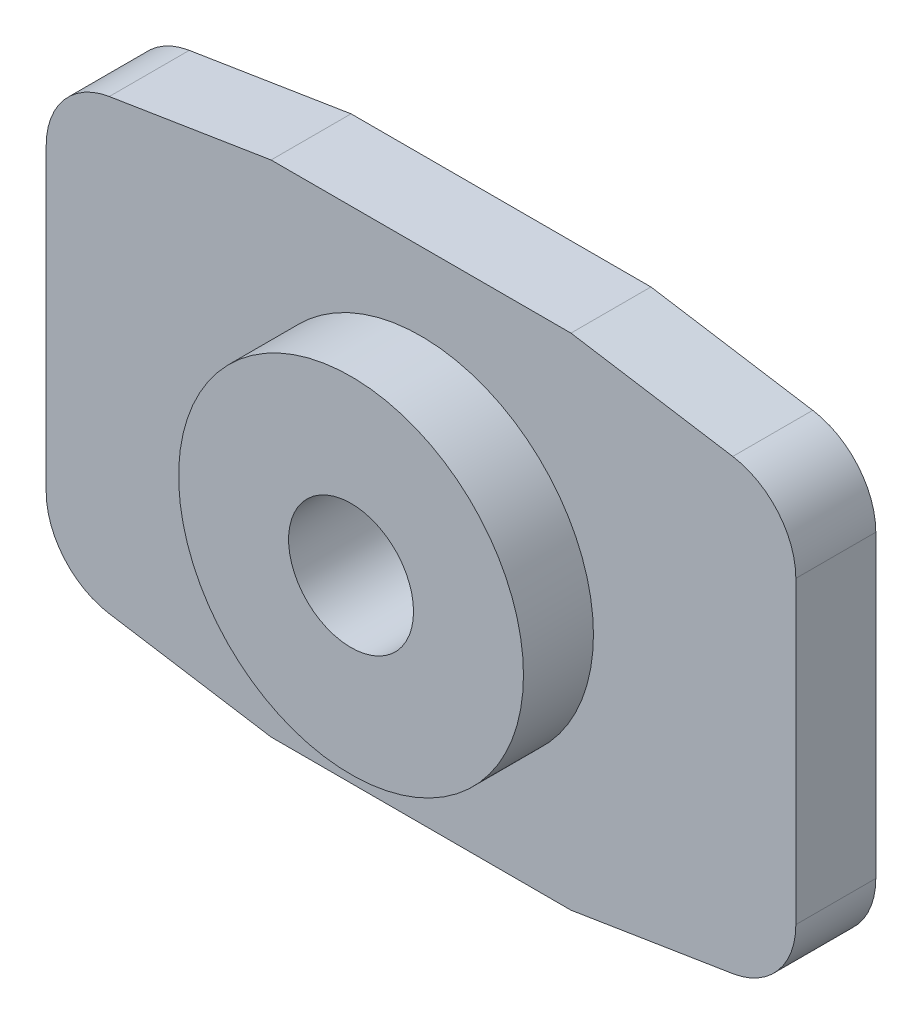
ISO-10303-21;
HEADER;
FILE_DESCRIPTION(('STEP AP214'),'2;1');
FILE_NAME('part.step','',(''),(''),'','','');
FILE_SCHEMA(('AUTOMOTIVE_DESIGN { 1 0 10303 214 1 1 1 1 }'));
ENDSEC;
DATA;
#1=APPLICATION_CONTEXT('core data for automotive mechanical design processes');
#2=APPLICATION_PROTOCOL_DEFINITION('international standard','automotive_design',2000,#1);
#3=PRODUCT_CONTEXT('',#1,'mechanical');
#4=PRODUCT('Part','Part','',(#3));
#5=PRODUCT_RELATED_PRODUCT_CATEGORY('part','',(#4));
#6=PRODUCT_DEFINITION_FORMATION('','',#4);
#7=PRODUCT_DEFINITION_CONTEXT('part definition',#1,'design');
#8=PRODUCT_DEFINITION('design','',#6,#7);
#9=PRODUCT_DEFINITION_SHAPE('','',#8);
#10=(LENGTH_UNIT() NAMED_UNIT(*) SI_UNIT(.MILLI.,.METRE.));
#11=(NAMED_UNIT(*) PLANE_ANGLE_UNIT() SI_UNIT($,.RADIAN.));
#12=(NAMED_UNIT(*) SI_UNIT($,.STERADIAN.) SOLID_ANGLE_UNIT());
#13=UNCERTAINTY_MEASURE_WITH_UNIT(LENGTH_MEASURE(1.E-05),#10,'distance_accuracy_value','');
#14=(GEOMETRIC_REPRESENTATION_CONTEXT(3) GLOBAL_UNCERTAINTY_ASSIGNED_CONTEXT((#13)) GLOBAL_UNIT_ASSIGNED_CONTEXT((#10,
#11,#12)) REPRESENTATION_CONTEXT('',''));
#15=CARTESIAN_POINT('',(0.,0.,0.));
#16=DIRECTION('',(0.,0.,1.));
#17=DIRECTION('',(1.,0.,0.));
#18=AXIS2_PLACEMENT_3D('',#15,#16,#17);
#19=CARTESIAN_POINT('',(6.00000000000023,3.00000000000011,1.60000000000242));
#20=DIRECTION('',(0.,0.,1.));
#21=DIRECTION('',(1.,0.,0.));
#22=AXIS2_PLACEMENT_3D('',#19,#20,#21);
#23=PLANE('',#22);
#24=CARTESIAN_POINT('',(6.00000000000023,3.00000000000011,1.60000000000242));
#25=DIRECTION('',(0.,0.,1.));
#26=DIRECTION('',(1.,0.,0.));
#27=AXIS2_PLACEMENT_3D('',#24,#25,#26);
#28=CIRCLE('',#27,1.5);
#29=CARTESIAN_POINT('',(7.50000000000028,3.00000000000011,1.6000000000044));
#30=VERTEX_POINT('',#29);
#31=CARTESIAN_POINT('',(6.23739675280444,4.48109512920603,1.60000000000005));
#32=VERTEX_POINT('',#31);
#33=EDGE_CURVE('E180',#30,#32,#28,.T.);
#34=ORIENTED_EDGE('',*,*,#33,.T.);
#35=DIRECTION('',(-0.987396752804084,0.158264501869387,0.));
#36=VECTOR('',#35,1.);
#37=CARTESIAN_POINT('',(6.23739675280444,4.48109512920603,1.60000000000005));
#38=LINE('',#37,#36);
#39=CARTESIAN_POINT('',(3.00000000000011,4.99999999999989,1.60000000000426));
#40=VERTEX_POINT('',#39);
#41=EDGE_CURVE('E108',#32,#40,#38,.T.);
#42=ORIENTED_EDGE('',*,*,#41,.T.);
#43=DIRECTION('',(-1.,0.,0.));
#44=VECTOR('',#43,1.);
#45=CARTESIAN_POINT('',(-3.00000000000011,4.99999999999989,1.60000000000456));
#46=LINE('',#45,#44);
#47=CARTESIAN_POINT('',(-3.00000000000011,4.99999999999989,1.60000000000456));
#48=VERTEX_POINT('',#47);
#49=EDGE_CURVE('E207',#40,#48,#46,.T.);
#50=ORIENTED_EDGE('',*,*,#49,.T.);
#51=DIRECTION('',(-0.987396752804084,-0.158264501869387,0.));
#52=VECTOR('',#51,1.);
#53=CARTESIAN_POINT('',(-6.23739675280444,4.48109512920603,1.60000000000016));
#54=LINE('',#53,#52);
#55=CARTESIAN_POINT('',(-6.23739675280444,4.48109512920603,1.60000000000016));
#56=VERTEX_POINT('',#55);
#57=EDGE_CURVE('E225',#48,#56,#54,.T.);
#58=ORIENTED_EDGE('',*,*,#57,.T.);
#59=CARTESIAN_POINT('',(-6.00000000000023,3.00000000000011,1.60000000000254));
#60=DIRECTION('',(0.,0.,1.));
#61=DIRECTION('',(-1.,0.,0.));
#62=AXIS2_PLACEMENT_3D('',#59,#60,#61);
#63=CIRCLE('',#62,1.5);
#64=CARTESIAN_POINT('',(-7.50000000000028,3.00000000000011,1.60000000000447));
#65=VERTEX_POINT('',#64);
#66=EDGE_CURVE('E222',#56,#65,#63,.T.);
#67=ORIENTED_EDGE('',*,*,#66,.T.);
#68=DIRECTION('',(0.,-1.,0.));
#69=VECTOR('',#68,1.);
#70=CARTESIAN_POINT('',(-7.50000000000028,-3.00000000000011,1.60000000000435));
#71=LINE('',#70,#69);
#72=CARTESIAN_POINT('',(-7.50000000000028,-3.00000000000011,1.60000000000435));
#73=VERTEX_POINT('',#72);
#74=EDGE_CURVE('E224',#65,#73,#71,.T.);
#75=ORIENTED_EDGE('',*,*,#74,.T.);
#76=CARTESIAN_POINT('',(-6.00000000000023,-3.00000000000011,1.60000000000259));
#77=DIRECTION('',(0.,0.,1.));
#78=DIRECTION('',(1.,0.,0.));
#79=AXIS2_PLACEMENT_3D('',#76,#77,#78);
#80=CIRCLE('',#79,1.5);
#81=CARTESIAN_POINT('',(-6.23739675280444,-4.48109512920603,1.60000000000024));
#82=VERTEX_POINT('',#81);
#83=EDGE_CURVE('E227',#73,#82,#80,.T.);
#84=ORIENTED_EDGE('',*,*,#83,.T.);
#85=DIRECTION('',(0.987396752804083,-0.158264501869386,0.));
#86=VECTOR('',#85,1.);
#87=CARTESIAN_POINT('',(-6.23739675280444,-4.48109512920603,1.60000000000024));
#88=LINE('',#87,#86);
#89=CARTESIAN_POINT('',(-3.00000000000011,-4.99999999999989,1.59999999999949));
#90=VERTEX_POINT('',#89);
#91=EDGE_CURVE('E233',#82,#90,#88,.T.);
#92=ORIENTED_EDGE('',*,*,#91,.T.);
#93=DIRECTION('',(1.,0.,0.));
#94=VECTOR('',#93,1.);
#95=CARTESIAN_POINT('',(-3.00000000000011,-4.99999999999989,1.59999999999949));
#96=LINE('',#95,#94);
#97=CARTESIAN_POINT('',(3.00000000000011,-4.99999999999989,1.59999999999984));
#98=VERTEX_POINT('',#97);
#99=EDGE_CURVE('E139',#90,#98,#96,.T.);
#100=ORIENTED_EDGE('',*,*,#99,.T.);
#101=DIRECTION('',(0.987396752804084,0.158264501869386,0.));
#102=VECTOR('',#101,1.);
#103=CARTESIAN_POINT('',(6.23739675280444,-4.48109512920603,1.59999999999987));
#104=LINE('',#103,#102);
#105=CARTESIAN_POINT('',(6.23739675280444,-4.48109512920603,1.59999999999987));
#106=VERTEX_POINT('',#105);
#107=EDGE_CURVE('E133',#98,#106,#104,.T.);
#108=ORIENTED_EDGE('',*,*,#107,.T.);
#109=CARTESIAN_POINT('',(6.00000000000023,-3.00000000000011,1.60000000000253));
#110=DIRECTION('',(0.,0.,1.));
#111=DIRECTION('',(-1.,0.,0.));
#112=AXIS2_PLACEMENT_3D('',#109,#110,#111);
#113=CIRCLE('',#112,1.5);
#114=CARTESIAN_POINT('',(7.50000000000028,-3.00000000000011,1.60000000000429));
#115=VERTEX_POINT('',#114);
#116=EDGE_CURVE('E137',#106,#115,#113,.T.);
#117=ORIENTED_EDGE('',*,*,#116,.T.);
#118=DIRECTION('',(0.,1.,0.));
#119=VECTOR('',#118,1.);
#120=CARTESIAN_POINT('',(7.50000000000028,-3.00000000000011,1.60000000000429));
#121=LINE('',#120,#119);
#122=EDGE_CURVE('E53',#115,#30,#121,.T.);
#123=ORIENTED_EDGE('',*,*,#122,.T.);
#124=EDGE_LOOP('',(#34,#42,#50,#58,#67,#75,#84,#92,#100,#108,#117,#123));
#125=FACE_BOUND('',#124,.T.);
#126=CARTESIAN_POINT('',(0.,0.,1.60000000000006));
#127=DIRECTION('',(0.,0.,1.));
#128=DIRECTION('',(1.,0.,0.));
#129=AXIS2_PLACEMENT_3D('',#126,#127,#128);
#130=CIRCLE('',#129,3.45);
#131=CARTESIAN_POINT('',(3.45000000000002,0.,1.60000000000006));
#132=VERTEX_POINT('',#131);
#133=EDGE_CURVE('E285',#132,#132,#130,.T.);
#134=ORIENTED_EDGE('',*,*,#133,.F.);
#135=EDGE_LOOP('',(#134));
#136=FACE_BOUND('',#135,.T.);
#137=ADVANCED_FACE('F36',(#125,#136),#23,.T.);
#138=CARTESIAN_POINT('',(6.00000000000023,3.00000000000011,1.60000000000242));
#139=DIRECTION('',(0.,0.,-1.));
#140=DIRECTION('',(-1.,0.,0.));
#141=AXIS2_PLACEMENT_3D('',#138,#139,#140);
#142=CYLINDRICAL_SURFACE('',#141,1.5);
#143=CARTESIAN_POINT('',(6.00000000000023,3.00000000000011,2.38697950294409E-12));
#144=DIRECTION('',(0.,0.,1.));
#145=DIRECTION('',(1.,0.,0.));
#146=AXIS2_PLACEMENT_3D('',#143,#144,#145);
#147=CIRCLE('',#146,1.5);
#148=CARTESIAN_POINT('',(7.50000000000028,3.00000000000011,4.56579218877096E-12));
#149=VERTEX_POINT('',#148);
#150=CARTESIAN_POINT('',(6.23739675280444,4.48109512920603,3.05311331771918E-13));
#151=VERTEX_POINT('',#150);
#152=EDGE_CURVE('E157',#149,#151,#147,.T.);
#153=ORIENTED_EDGE('',*,*,#152,.T.);
#154=DIRECTION('',(0.,0.,-1.));
#155=VECTOR('',#154,1.);
#156=CARTESIAN_POINT('',(6.23739675280444,4.48109512920603,1.60000000000005));
#157=LINE('',#156,#155);
#158=EDGE_CURVE('E11',#32,#151,#157,.T.);
#159=ORIENTED_EDGE('',*,*,#158,.F.);
#160=ORIENTED_EDGE('',*,*,#33,.F.);
#161=DIRECTION('',(0.,0.,-1.));
#162=VECTOR('',#161,1.);
#163=CARTESIAN_POINT('',(7.50000000000028,3.00000000000011,1.6000000000044));
#164=LINE('',#163,#162);
#165=EDGE_CURVE('E153',#30,#149,#164,.T.);
#166=ORIENTED_EDGE('',*,*,#165,.T.);
#167=EDGE_LOOP('',(#153,#159,#160,#166));
#168=FACE_BOUND('',#167,.T.);
#169=ADVANCED_FACE('F38',(#168),#142,.T.);
#170=CARTESIAN_POINT('',(6.23739675280444,4.48109512920603,1.60000000000005));
#171=DIRECTION('',(-0.158264501869386,-0.987396752804081,0.));
#172=DIRECTION('',(0.987396752804084,-0.158264501869387,0.));
#173=AXIS2_PLACEMENT_3D('',#170,#171,#172);
#174=PLANE('',#173);
#175=DIRECTION('',(-0.987396752804084,0.158264501869387,0.));
#176=VECTOR('',#175,1.);
#177=CARTESIAN_POINT('',(6.23739675280444,4.48109512920603,3.05311331771918E-13));
#178=LINE('',#177,#176);
#179=CARTESIAN_POINT('',(3.00000000000011,4.99999999999989,4.34374758384592E-12));
#180=VERTEX_POINT('',#179);
#181=EDGE_CURVE('E160',#151,#180,#178,.T.);
#182=ORIENTED_EDGE('',*,*,#181,.T.);
#183=DIRECTION('',(0.,0.,-1.));
#184=VECTOR('',#183,1.);
#185=CARTESIAN_POINT('',(3.00000000000011,4.99999999999989,1.60000000000426));
#186=LINE('',#185,#184);
#187=EDGE_CURVE('E45',#40,#180,#186,.T.);
#188=ORIENTED_EDGE('',*,*,#187,.F.);
#189=ORIENTED_EDGE('',*,*,#41,.F.);
#190=ORIENTED_EDGE('',*,*,#158,.T.);
#191=EDGE_LOOP('',(#182,#188,#189,#190));
#192=FACE_BOUND('',#191,.T.);
#193=ADVANCED_FACE('F263',(#192),#174,.F.);
#194=CARTESIAN_POINT('',(-3.00000000000011,4.99999999999989,1.60000000000456));
#195=DIRECTION('',(0.,-1.,0.));
#196=DIRECTION('',(0.,0.,-1.));
#197=AXIS2_PLACEMENT_3D('',#194,#195,#196);
#198=PLANE('',#197);
#199=DIRECTION('',(-1.,0.,0.));
#200=VECTOR('',#199,1.);
#201=CARTESIAN_POINT('',(-3.00000000000011,4.99999999999989,4.21884749357559E-12));
#202=LINE('',#201,#200);
#203=CARTESIAN_POINT('',(-3.00000000000011,4.99999999999989,4.21884749357559E-12));
#204=VERTEX_POINT('',#203);
#205=EDGE_CURVE('E163',#180,#204,#202,.T.);
#206=ORIENTED_EDGE('',*,*,#205,.T.);
#207=DIRECTION('',(0.,0.,-1.));
#208=VECTOR('',#207,1.);
#209=CARTESIAN_POINT('',(-3.00000000000011,4.99999999999989,1.60000000000456));
#210=LINE('',#209,#208);
#211=EDGE_CURVE('E199',#48,#204,#210,.T.);
#212=ORIENTED_EDGE('',*,*,#211,.F.);
#213=ORIENTED_EDGE('',*,*,#49,.F.);
#214=ORIENTED_EDGE('',*,*,#187,.T.);
#215=EDGE_LOOP('',(#206,#212,#213,#214));
#216=FACE_BOUND('',#215,.T.);
#217=ADVANCED_FACE('F205',(#216),#198,.F.);
#218=CARTESIAN_POINT('',(-6.23739675280444,4.48109512920603,1.60000000000016));
#219=DIRECTION('',(0.158264501869387,-0.987396752804081,0.));
#220=DIRECTION('',(0.987396752804083,0.158264501869386,0.));
#221=AXIS2_PLACEMENT_3D('',#218,#219,#220);
#222=PLANE('',#221);
#223=DIRECTION('',(-0.987396752804084,-0.158264501869387,0.));
#224=VECTOR('',#223,1.);
#225=CARTESIAN_POINT('',(-6.23739675280444,4.48109512920603,2.22044604925031E-13));
#226=LINE('',#225,#224);
#227=CARTESIAN_POINT('',(-6.23739675280444,4.48109512920603,2.22044604925031E-13));
#228=VERTEX_POINT('',#227);
#229=EDGE_CURVE('E165',#204,#228,#226,.T.);
#230=ORIENTED_EDGE('',*,*,#229,.T.);
#231=DIRECTION('',(0.,0.,-1.));
#232=VECTOR('',#231,1.);
#233=CARTESIAN_POINT('',(-6.23739675280444,4.48109512920603,1.60000000000016));
#234=LINE('',#233,#232);
#235=EDGE_CURVE('E196',#56,#228,#234,.T.);
#236=ORIENTED_EDGE('',*,*,#235,.F.);
#237=ORIENTED_EDGE('',*,*,#57,.F.);
#238=ORIENTED_EDGE('',*,*,#211,.T.);
#239=EDGE_LOOP('',(#230,#236,#237,#238));
#240=FACE_BOUND('',#239,.T.);
#241=ADVANCED_FACE('F216',(#240),#222,.F.);
#242=CARTESIAN_POINT('',(-6.00000000000023,3.00000000000011,1.60000000000254));
#243=DIRECTION('',(0.,0.,-1.));
#244=DIRECTION('',(-1.,0.,0.));
#245=AXIS2_PLACEMENT_3D('',#242,#243,#244);
#246=CYLINDRICAL_SURFACE('',#245,1.5);
#247=CARTESIAN_POINT('',(-6.00000000000023,3.00000000000011,2.72004641033163E-12));
#248=DIRECTION('',(0.,0.,1.));
#249=DIRECTION('',(-1.,0.,0.));
#250=AXIS2_PLACEMENT_3D('',#247,#248,#249);
#251=CIRCLE('',#250,1.5);
#252=CARTESIAN_POINT('',(-7.50000000000028,3.00000000000011,4.48252546192407E-12));
#253=VERTEX_POINT('',#252);
#254=EDGE_CURVE('E167',#228,#253,#251,.T.);
#255=ORIENTED_EDGE('',*,*,#254,.T.);
#256=DIRECTION('',(0.,0.,-1.));
#257=VECTOR('',#256,1.);
#258=CARTESIAN_POINT('',(-7.50000000000028,3.00000000000011,1.60000000000447));
#259=LINE('',#258,#257);
#260=EDGE_CURVE('E193',#65,#253,#259,.T.);
#261=ORIENTED_EDGE('',*,*,#260,.F.);
#262=ORIENTED_EDGE('',*,*,#66,.F.);
#263=ORIENTED_EDGE('',*,*,#235,.T.);
#264=EDGE_LOOP('',(#255,#261,#262,#263));
#265=FACE_BOUND('',#264,.T.);
#266=ADVANCED_FACE('F220',(#265),#246,.T.);
#267=CARTESIAN_POINT('',(-7.50000000000028,-3.00000000000011,1.60000000000435));
#268=DIRECTION('',(1.,0.,0.));
#269=DIRECTION('',(0.,0.,-1.));
#270=AXIS2_PLACEMENT_3D('',#267,#268,#269);
#271=PLANE('',#270);
#272=DIRECTION('',(0.,-1.,0.));
#273=VECTOR('',#272,1.);
#274=CARTESIAN_POINT('',(-7.50000000000028,-3.00000000000011,4.20496970576778E-12));
#275=LINE('',#274,#273);
#276=CARTESIAN_POINT('',(-7.50000000000028,-3.00000000000011,4.20496970576778E-12));
#277=VERTEX_POINT('',#276);
#278=EDGE_CURVE('E169',#253,#277,#275,.T.);
#279=ORIENTED_EDGE('',*,*,#278,.T.);
#280=DIRECTION('',(0.,0.,-1.));
#281=VECTOR('',#280,1.);
#282=CARTESIAN_POINT('',(-7.50000000000028,-3.00000000000011,1.60000000000435));
#283=LINE('',#282,#281);
#284=EDGE_CURVE('E190',#73,#277,#283,.T.);
#285=ORIENTED_EDGE('',*,*,#284,.F.);
#286=ORIENTED_EDGE('',*,*,#74,.F.);
#287=ORIENTED_EDGE('',*,*,#260,.T.);
#288=EDGE_LOOP('',(#279,#285,#286,#287));
#289=FACE_BOUND('',#288,.T.);
#290=ADVANCED_FACE('F354',(#289),#271,.F.);
#291=CARTESIAN_POINT('',(-6.00000000000023,-3.00000000000011,1.60000000000259));
#292=DIRECTION('',(0.,0.,-1.));
#293=DIRECTION('',(-1.,0.,0.));
#294=AXIS2_PLACEMENT_3D('',#291,#292,#293);
#295=CYLINDRICAL_SURFACE('',#294,1.5);
#296=CARTESIAN_POINT('',(-6.00000000000023,-3.00000000000011,2.94209101525666E-12));
#297=DIRECTION('',(0.,0.,1.));
#298=DIRECTION('',(1.,0.,0.));
#299=AXIS2_PLACEMENT_3D('',#296,#297,#298);
#300=CIRCLE('',#299,1.5);
#301=CARTESIAN_POINT('',(-6.23739675280444,-4.48109512920603,1.11022302462516E-13));
#302=VERTEX_POINT('',#301);
#303=EDGE_CURVE('E171',#277,#302,#300,.T.);
#304=ORIENTED_EDGE('',*,*,#303,.T.);
#305=DIRECTION('',(0.,0.,-1.));
#306=VECTOR('',#305,1.);
#307=CARTESIAN_POINT('',(-6.23739675280444,-4.48109512920603,1.60000000000024));
#308=LINE('',#307,#306);
#309=EDGE_CURVE('E187',#82,#302,#308,.T.);
#310=ORIENTED_EDGE('',*,*,#309,.F.);
#311=ORIENTED_EDGE('',*,*,#83,.F.);
#312=ORIENTED_EDGE('',*,*,#284,.T.);
#313=EDGE_LOOP('',(#304,#310,#311,#312));
#314=FACE_BOUND('',#313,.T.);
#315=ADVANCED_FACE('F345',(#314),#295,.T.);
#316=CARTESIAN_POINT('',(-6.23739675280444,-4.48109512920603,1.60000000000024));
#317=DIRECTION('',(0.158264501869386,0.987396752804081,0.));
#318=DIRECTION('',(-0.987396752804084,0.158264501869386,0.));
#319=AXIS2_PLACEMENT_3D('',#316,#317,#318);
#320=PLANE('',#319);
#321=DIRECTION('',(0.987396752804083,-0.158264501869386,0.));
#322=VECTOR('',#321,1.);
#323=CARTESIAN_POINT('',(-6.23739675280444,-4.48109512920603,1.11022302462516E-13));
#324=LINE('',#323,#322);
#325=CARTESIAN_POINT('',(-3.00000000000011,-4.99999999999989,-5.13478148889135E-13));
#326=VERTEX_POINT('',#325);
#327=EDGE_CURVE('E173',#302,#326,#324,.T.);
#328=ORIENTED_EDGE('',*,*,#327,.T.);
#329=DIRECTION('',(0.,0.,-1.));
#330=VECTOR('',#329,1.);
#331=CARTESIAN_POINT('',(-3.00000000000011,-4.99999999999989,1.59999999999949));
#332=LINE('',#331,#330);
#333=EDGE_CURVE('E184',#90,#326,#332,.T.);
#334=ORIENTED_EDGE('',*,*,#333,.F.);
#335=ORIENTED_EDGE('',*,*,#91,.F.);
#336=ORIENTED_EDGE('',*,*,#309,.T.);
#337=EDGE_LOOP('',(#328,#334,#335,#336));
#338=FACE_BOUND('',#337,.T.);
#339=ADVANCED_FACE('F239',(#338),#320,.F.);
#340=CARTESIAN_POINT('',(-3.00000000000011,-4.99999999999989,1.59999999999949));
#341=DIRECTION('',(0.,1.,0.));
#342=DIRECTION('',(0.,0.,1.));
#343=AXIS2_PLACEMENT_3D('',#340,#341,#342);
#344=PLANE('',#343);
#345=DIRECTION('',(1.,0.,0.));
#346=VECTOR('',#345,1.);
#347=CARTESIAN_POINT('',(-3.00000000000011,-4.99999999999989,-5.13478148889135E-13));
#348=LINE('',#347,#346);
#349=CARTESIAN_POINT('',(3.00000000000011,-4.99999999999989,-8.04911692853238E-13));
#350=VERTEX_POINT('',#349);
#351=EDGE_CURVE('E175',#326,#350,#348,.T.);
#352=ORIENTED_EDGE('',*,*,#351,.T.);
#353=DIRECTION('',(0.,0.,-1.));
#354=VECTOR('',#353,1.);
#355=CARTESIAN_POINT('',(3.00000000000011,-4.99999999999989,1.59999999999984));
#356=LINE('',#355,#354);
#357=EDGE_CURVE('E148',#98,#350,#356,.T.);
#358=ORIENTED_EDGE('',*,*,#357,.F.);
#359=ORIENTED_EDGE('',*,*,#99,.F.);
#360=ORIENTED_EDGE('',*,*,#333,.T.);
#361=EDGE_LOOP('',(#352,#358,#359,#360));
#362=FACE_BOUND('',#361,.T.);
#363=ADVANCED_FACE('F243',(#362),#344,.F.);
#364=CARTESIAN_POINT('',(6.23739675280444,-4.48109512920603,1.59999999999987));
#365=DIRECTION('',(-0.158264501869387,0.987396752804081,0.));
#366=DIRECTION('',(-0.987396752804084,-0.158264501869386,0.));
#367=AXIS2_PLACEMENT_3D('',#364,#365,#366);
#368=PLANE('',#367);
#369=DIRECTION('',(0.987396752804084,0.158264501869386,0.));
#370=VECTOR('',#369,1.);
#371=CARTESIAN_POINT('',(6.23739675280444,-4.48109512920603,1.66533453693773E-13));
#372=LINE('',#371,#370);
#373=CARTESIAN_POINT('',(6.23739675280444,-4.48109512920603,1.66533453693773E-13));
#374=VERTEX_POINT('',#373);
#375=EDGE_CURVE('E147',#350,#374,#372,.T.);
#376=ORIENTED_EDGE('',*,*,#375,.T.);
#377=DIRECTION('',(0.,0.,-1.));
#378=VECTOR('',#377,1.);
#379=CARTESIAN_POINT('',(6.23739675280444,-4.48109512920603,1.59999999999987));
#380=LINE('',#379,#378);
#381=EDGE_CURVE('E144',#106,#374,#380,.T.);
#382=ORIENTED_EDGE('',*,*,#381,.F.);
#383=ORIENTED_EDGE('',*,*,#107,.F.);
#384=ORIENTED_EDGE('',*,*,#357,.T.);
#385=EDGE_LOOP('',(#376,#382,#383,#384));
#386=FACE_BOUND('',#385,.T.);
#387=ADVANCED_FACE('F145',(#386),#368,.F.);
#388=CARTESIAN_POINT('',(6.00000000000023,-3.00000000000011,1.60000000000253));
#389=DIRECTION('',(0.,0.,-1.));
#390=DIRECTION('',(-1.,0.,0.));
#391=AXIS2_PLACEMENT_3D('',#388,#389,#390);
#392=CYLINDRICAL_SURFACE('',#391,1.5);
#393=CARTESIAN_POINT('',(6.00000000000023,-3.00000000000011,2.4008572907519E-12));
#394=DIRECTION('',(0.,0.,1.));
#395=DIRECTION('',(-1.,0.,0.));
#396=AXIS2_PLACEMENT_3D('',#393,#394,#395);
#397=CIRCLE('',#396,1.5);
#398=CARTESIAN_POINT('',(7.50000000000028,-3.00000000000011,3.99680288865056E-12));
#399=VERTEX_POINT('',#398);
#400=EDGE_CURVE('E94',#374,#399,#397,.T.);
#401=ORIENTED_EDGE('',*,*,#400,.T.);
#402=DIRECTION('',(0.,0.,-1.));
#403=VECTOR('',#402,1.);
#404=CARTESIAN_POINT('',(7.50000000000028,-3.00000000000011,1.60000000000429));
#405=LINE('',#404,#403);
#406=EDGE_CURVE('E149',#115,#399,#405,.T.);
#407=ORIENTED_EDGE('',*,*,#406,.F.);
#408=ORIENTED_EDGE('',*,*,#116,.F.);
#409=ORIENTED_EDGE('',*,*,#381,.T.);
#410=EDGE_LOOP('',(#401,#407,#408,#409));
#411=FACE_BOUND('',#410,.T.);
#412=ADVANCED_FACE('F151',(#411),#392,.T.);
#413=CARTESIAN_POINT('',(7.50000000000028,-3.00000000000011,1.60000000000429));
#414=DIRECTION('',(-1.00000000000001,0.,0.));
#415=DIRECTION('',(0.,-1.,0.));
#416=AXIS2_PLACEMENT_3D('',#413,#414,#415);
#417=PLANE('',#416);
#418=DIRECTION('',(0.,1.,0.));
#419=VECTOR('',#418,1.);
#420=CARTESIAN_POINT('',(7.50000000000028,-3.00000000000011,3.99680288865056E-12));
#421=LINE('',#420,#419);
#422=EDGE_CURVE('E100',#399,#149,#421,.T.);
#423=ORIENTED_EDGE('',*,*,#422,.T.);
#424=ORIENTED_EDGE('',*,*,#165,.F.);
#425=ORIENTED_EDGE('',*,*,#122,.F.);
#426=ORIENTED_EDGE('',*,*,#406,.T.);
#427=EDGE_LOOP('',(#423,#424,#425,#426));
#428=FACE_BOUND('',#427,.T.);
#429=ADVANCED_FACE('F247',(#428),#417,.F.);
#430=CARTESIAN_POINT('',(6.00000000000023,3.00000000000011,2.38697950294409E-12));
#431=DIRECTION('',(0.,0.,1.));
#432=DIRECTION('',(1.,0.,0.));
#433=AXIS2_PLACEMENT_3D('',#430,#431,#432);
#434=PLANE('',#433);
#435=CARTESIAN_POINT('',(0.,0.,0.));
#436=DIRECTION('',(0.,0.,1.));
#437=DIRECTION('',(1.,0.,0.));
#438=AXIS2_PLACEMENT_3D('',#435,#436,#437);
#439=CIRCLE('',#438,1.25);
#440=CARTESIAN_POINT('',(1.25,0.,0.));
#441=VERTEX_POINT('',#440);
#442=EDGE_CURVE('E280',#441,#441,#439,.T.);
#443=ORIENTED_EDGE('',*,*,#442,.T.);
#444=EDGE_LOOP('',(#443));
#445=FACE_BOUND('',#444,.T.);
#446=ORIENTED_EDGE('',*,*,#152,.F.);
#447=ORIENTED_EDGE('',*,*,#422,.F.);
#448=ORIENTED_EDGE('',*,*,#400,.F.);
#449=ORIENTED_EDGE('',*,*,#375,.F.);
#450=ORIENTED_EDGE('',*,*,#351,.F.);
#451=ORIENTED_EDGE('',*,*,#327,.F.);
#452=ORIENTED_EDGE('',*,*,#303,.F.);
#453=ORIENTED_EDGE('',*,*,#278,.F.);
#454=ORIENTED_EDGE('',*,*,#254,.F.);
#455=ORIENTED_EDGE('',*,*,#229,.F.);
#456=ORIENTED_EDGE('',*,*,#205,.F.);
#457=ORIENTED_EDGE('',*,*,#181,.F.);
#458=EDGE_LOOP('',(#446,#447,#448,#449,#450,#451,#452,#453,#454,#455,#456,#457));
#459=FACE_BOUND('',#458,.T.);
#460=ADVANCED_FACE('F211',(#445,#459),#434,.F.);
#461=CARTESIAN_POINT('',(0.,0.,2.99999999999995));
#462=DIRECTION('',(0.,0.,-1.));
#463=DIRECTION('',(-1.,0.,0.));
#464=AXIS2_PLACEMENT_3D('',#461,#462,#463);
#465=CYLINDRICAL_SURFACE('',#464,3.45);
#466=CARTESIAN_POINT('',(0.,0.,2.99999999999995));
#467=DIRECTION('',(0.,0.,1.));
#468=DIRECTION('',(1.,0.,0.));
#469=AXIS2_PLACEMENT_3D('',#466,#467,#468);
#470=CIRCLE('',#469,3.45);
#471=CARTESIAN_POINT('',(3.45000000000002,0.,2.99999999999994));
#472=VERTEX_POINT('',#471);
#473=EDGE_CURVE('E161',#472,#472,#470,.T.);
#474=ORIENTED_EDGE('',*,*,#473,.F.);
#475=EDGE_LOOP('',(#474));
#476=FACE_BOUND('',#475,.T.);
#477=ORIENTED_EDGE('',*,*,#133,.T.);
#478=EDGE_LOOP('',(#477));
#479=FACE_BOUND('',#478,.T.);
#480=ADVANCED_FACE('F254',(#476,#479),#465,.T.);
#481=CARTESIAN_POINT('',(0.,0.,2.99999999999995));
#482=DIRECTION('',(0.,0.,1.));
#483=DIRECTION('',(1.,0.,0.));
#484=AXIS2_PLACEMENT_3D('',#481,#482,#483);
#485=PLANE('',#484);
#486=CARTESIAN_POINT('',(0.,0.,2.99999999999995));
#487=DIRECTION('',(0.,0.,1.));
#488=DIRECTION('',(1.,0.,0.));
#489=AXIS2_PLACEMENT_3D('',#486,#487,#488);
#490=CIRCLE('',#489,1.25);
#491=CARTESIAN_POINT('',(1.25000000000001,0.,2.99999999999995));
#492=VERTEX_POINT('',#491);
#493=EDGE_CURVE('E283',#492,#492,#490,.T.);
#494=ORIENTED_EDGE('',*,*,#493,.F.);
#495=EDGE_LOOP('',(#494));
#496=FACE_BOUND('',#495,.T.);
#497=ORIENTED_EDGE('',*,*,#473,.T.);
#498=EDGE_LOOP('',(#497));
#499=FACE_BOUND('',#498,.T.);
#500=ADVANCED_FACE('F267',(#496,#499),#485,.T.);
#501=CARTESIAN_POINT('',(0.,0.,2.99999999999995));
#502=DIRECTION('',(0.,0.,1.));
#503=DIRECTION('',(1.,0.,0.));
#504=AXIS2_PLACEMENT_3D('',#501,#502,#503);
#505=CYLINDRICAL_SURFACE('',#504,1.25);
#506=ORIENTED_EDGE('',*,*,#442,.F.);
#507=EDGE_LOOP('',(#506));
#508=FACE_BOUND('',#507,.T.);
#509=ORIENTED_EDGE('',*,*,#493,.T.);
#510=EDGE_LOOP('',(#509));
#511=FACE_BOUND('',#510,.T.);
#512=ADVANCED_FACE('F271',(#508,#511),#505,.F.);
#513=CLOSED_SHELL('',(#137,#169,#193,#217,#241,#266,#290,#315,#339,#363,#387,#412,#429,#460,
#480,#500,#512));
#514=MANIFOLD_SOLID_BREP('B2',#513);
#515=ADVANCED_BREP_SHAPE_REPRESENTATION('',(#18,#514),#14);
#516=SHAPE_DEFINITION_REPRESENTATION(#9,#515);
ENDSEC;
END-ISO-10303-21;
